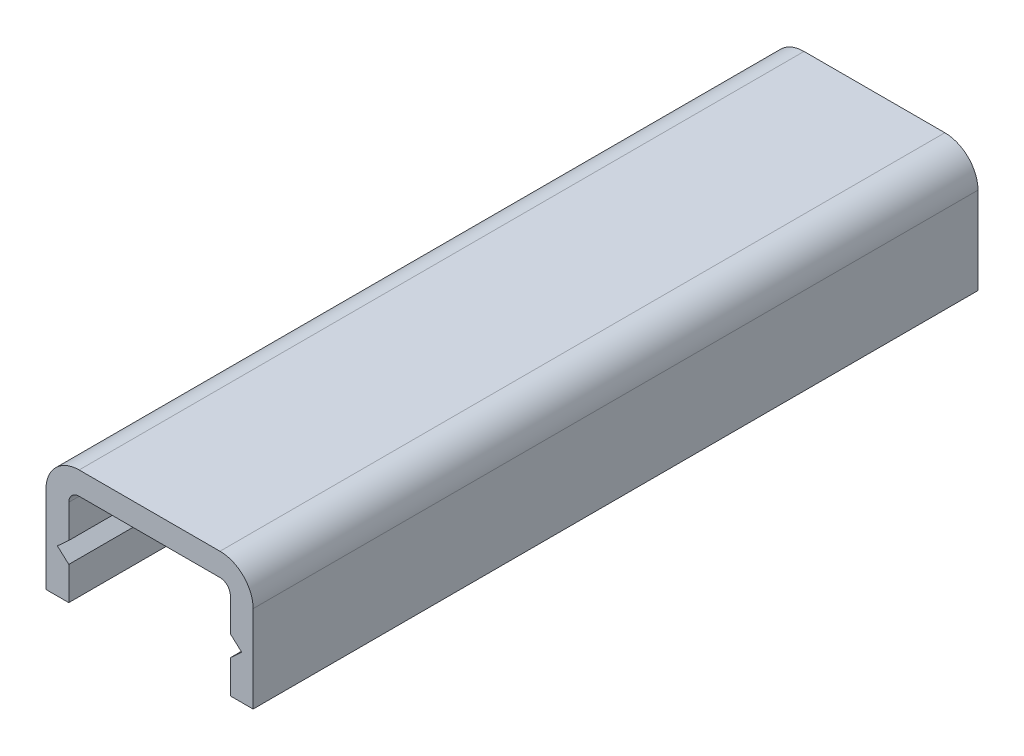
ISO-10303-21;
HEADER;
FILE_DESCRIPTION(('STEP AP214'),'2;1');
FILE_NAME('part.step','',(''),(''),'','','');
FILE_SCHEMA(('AUTOMOTIVE_DESIGN { 1 0 10303 214 1 1 1 1 }'));
ENDSEC;
DATA;
#1=APPLICATION_CONTEXT('core data for automotive mechanical design processes');
#2=APPLICATION_PROTOCOL_DEFINITION('international standard','automotive_design',2000,#1);
#3=PRODUCT_CONTEXT('',#1,'mechanical');
#4=PRODUCT('Part','Part','',(#3));
#5=PRODUCT_RELATED_PRODUCT_CATEGORY('part','',(#4));
#6=PRODUCT_DEFINITION_FORMATION('','',#4);
#7=PRODUCT_DEFINITION_CONTEXT('part definition',#1,'design');
#8=PRODUCT_DEFINITION('design','',#6,#7);
#9=PRODUCT_DEFINITION_SHAPE('','',#8);
#10=(LENGTH_UNIT() NAMED_UNIT(*) SI_UNIT(.MILLI.,.METRE.));
#11=(NAMED_UNIT(*) PLANE_ANGLE_UNIT() SI_UNIT($,.RADIAN.));
#12=(NAMED_UNIT(*) SI_UNIT($,.STERADIAN.) SOLID_ANGLE_UNIT());
#13=UNCERTAINTY_MEASURE_WITH_UNIT(LENGTH_MEASURE(1.E-05),#10,'distance_accuracy_value','');
#14=(GEOMETRIC_REPRESENTATION_CONTEXT(3) GLOBAL_UNCERTAINTY_ASSIGNED_CONTEXT((#13)) GLOBAL_UNIT_ASSIGNED_CONTEXT((#10,
#11,#12)) REPRESENTATION_CONTEXT('',''));
#15=CARTESIAN_POINT('',(0.,0.,0.));
#16=DIRECTION('',(0.,0.,1.));
#17=DIRECTION('',(1.,0.,0.));
#18=AXIS2_PLACEMENT_3D('',#15,#16,#17);
#19=CARTESIAN_POINT('',(0.,-5.8,35.));
#20=DIRECTION('',(0.,1.,0.));
#21=DIRECTION('',(0.,0.,1.));
#22=AXIS2_PLACEMENT_3D('',#19,#20,#21);
#23=PLANE('',#22);
#24=DIRECTION('',(1.,0.,0.));
#25=VECTOR('',#24,1.);
#26=CARTESIAN_POINT('',(0.,-5.8,0.));
#27=LINE('',#26,#25);
#28=CARTESIAN_POINT('',(0.,-5.8,0.));
#29=VERTEX_POINT('',#28);
#30=CARTESIAN_POINT('',(1.1,-5.8,0.));
#31=VERTEX_POINT('',#30);
#32=EDGE_CURVE('E187',#29,#31,#27,.T.);
#33=ORIENTED_EDGE('',*,*,#32,.T.);
#34=DIRECTION('',(0.,0.,-1.));
#35=VECTOR('',#34,1.);
#36=CARTESIAN_POINT('',(1.1,-5.8,35.));
#37=LINE('',#36,#35);
#38=CARTESIAN_POINT('',(1.1,-5.8,35.));
#39=VERTEX_POINT('',#38);
#40=EDGE_CURVE('E11',#39,#31,#37,.T.);
#41=ORIENTED_EDGE('',*,*,#40,.F.);
#42=DIRECTION('',(1.,0.,0.));
#43=VECTOR('',#42,1.);
#44=CARTESIAN_POINT('',(0.,-5.8,35.));
#45=LINE('',#44,#43);
#46=CARTESIAN_POINT('',(0.,-5.8,35.));
#47=VERTEX_POINT('',#46);
#48=EDGE_CURVE('E221',#47,#39,#45,.T.);
#49=ORIENTED_EDGE('',*,*,#48,.F.);
#50=DIRECTION('',(0.,0.,-1.));
#51=VECTOR('',#50,1.);
#52=CARTESIAN_POINT('',(0.,-5.8,35.));
#53=LINE('',#52,#51);
#54=EDGE_CURVE('E183',#47,#29,#53,.T.);
#55=ORIENTED_EDGE('',*,*,#54,.T.);
#56=EDGE_LOOP('',(#33,#41,#49,#55));
#57=FACE_BOUND('',#56,.T.);
#58=ADVANCED_FACE('F31',(#57),#23,.F.);
#59=CARTESIAN_POINT('',(1.1,-4.2,35.));
#60=DIRECTION('',(-1.,0.,0.));
#61=DIRECTION('',(0.,-1.,0.));
#62=AXIS2_PLACEMENT_3D('',#59,#60,#61);
#63=PLANE('',#62);
#64=DIRECTION('',(0.,1.,0.));
#65=VECTOR('',#64,1.);
#66=CARTESIAN_POINT('',(1.1,-4.2,0.));
#67=LINE('',#66,#65);
#68=CARTESIAN_POINT('',(1.1,-4.2,0.));
#69=VERTEX_POINT('',#68);
#70=EDGE_CURVE('E190',#31,#69,#67,.T.);
#71=ORIENTED_EDGE('',*,*,#70,.T.);
#72=DIRECTION('',(0.,0.,-1.));
#73=VECTOR('',#72,1.);
#74=CARTESIAN_POINT('',(1.1,-4.2,35.));
#75=LINE('',#74,#73);
#76=CARTESIAN_POINT('',(1.1,-4.2,35.));
#77=VERTEX_POINT('',#76);
#78=EDGE_CURVE('E39',#77,#69,#75,.T.);
#79=ORIENTED_EDGE('',*,*,#78,.F.);
#80=DIRECTION('',(0.,1.,0.));
#81=VECTOR('',#80,1.);
#82=CARTESIAN_POINT('',(1.1,-4.2,35.));
#83=LINE('',#82,#81);
#84=EDGE_CURVE('E120',#39,#77,#83,.T.);
#85=ORIENTED_EDGE('',*,*,#84,.F.);
#86=ORIENTED_EDGE('',*,*,#40,.T.);
#87=EDGE_LOOP('',(#71,#79,#85,#86));
#88=FACE_BOUND('',#87,.T.);
#89=ADVANCED_FACE('F329',(#88),#63,.F.);
#90=CARTESIAN_POINT('',(1.1,-4.2,35.));
#91=DIRECTION('',(-0.672672793996316,-0.73994007339594,0.));
#92=DIRECTION('',(0.73994007339594,-0.672672793996316,0.));
#93=AXIS2_PLACEMENT_3D('',#90,#91,#92);
#94=PLANE('',#93);
#95=DIRECTION('',(-0.73994007339594,0.672672793996316,0.));
#96=VECTOR('',#95,1.);
#97=CARTESIAN_POINT('',(1.1,-4.2,0.));
#98=LINE('',#97,#96);
#99=CARTESIAN_POINT('',(0.55,-3.7,0.));
#100=VERTEX_POINT('',#99);
#101=EDGE_CURVE('E192',#69,#100,#98,.T.);
#102=ORIENTED_EDGE('',*,*,#101,.T.);
#103=DIRECTION('',(0.,0.,-1.));
#104=VECTOR('',#103,1.);
#105=CARTESIAN_POINT('',(0.55,-3.7,35.));
#106=LINE('',#105,#104);
#107=CARTESIAN_POINT('',(0.55,-3.7,35.));
#108=VERTEX_POINT('',#107);
#109=EDGE_CURVE('E258',#108,#100,#106,.T.);
#110=ORIENTED_EDGE('',*,*,#109,.F.);
#111=DIRECTION('',(-0.73994007339594,0.672672793996316,0.));
#112=VECTOR('',#111,1.);
#113=CARTESIAN_POINT('',(1.1,-4.2,35.));
#114=LINE('',#113,#112);
#115=EDGE_CURVE('E266',#77,#108,#114,.T.);
#116=ORIENTED_EDGE('',*,*,#115,.F.);
#117=ORIENTED_EDGE('',*,*,#78,.T.);
#118=EDGE_LOOP('',(#102,#110,#116,#117));
#119=FACE_BOUND('',#118,.T.);
#120=ADVANCED_FACE('F264',(#119),#94,.F.);
#121=CARTESIAN_POINT('',(1.1,-3.2,35.));
#122=DIRECTION('',(-0.672672793996311,0.739940073395945,0.));
#123=DIRECTION('',(-0.739940073395945,-0.672672793996311,0.));
#124=AXIS2_PLACEMENT_3D('',#121,#122,#123);
#125=PLANE('',#124);
#126=DIRECTION('',(0.739940073395945,0.672672793996311,0.));
#127=VECTOR('',#126,1.);
#128=CARTESIAN_POINT('',(1.1,-3.2,0.));
#129=LINE('',#128,#127);
#130=CARTESIAN_POINT('',(1.1,-3.2,0.));
#131=VERTEX_POINT('',#130);
#132=EDGE_CURVE('E194',#100,#131,#129,.T.);
#133=ORIENTED_EDGE('',*,*,#132,.T.);
#134=DIRECTION('',(0.,0.,-1.));
#135=VECTOR('',#134,1.);
#136=CARTESIAN_POINT('',(1.1,-3.2,35.));
#137=LINE('',#136,#135);
#138=CARTESIAN_POINT('',(1.1,-3.2,35.));
#139=VERTEX_POINT('',#138);
#140=EDGE_CURVE('E255',#139,#131,#137,.T.);
#141=ORIENTED_EDGE('',*,*,#140,.F.);
#142=DIRECTION('',(0.739940073395945,0.672672793996311,0.));
#143=VECTOR('',#142,1.);
#144=CARTESIAN_POINT('',(1.1,-3.2,35.));
#145=LINE('',#144,#143);
#146=EDGE_CURVE('E284',#108,#139,#145,.T.);
#147=ORIENTED_EDGE('',*,*,#146,.F.);
#148=ORIENTED_EDGE('',*,*,#109,.T.);
#149=EDGE_LOOP('',(#133,#141,#147,#148));
#150=FACE_BOUND('',#149,.T.);
#151=ADVANCED_FACE('F275',(#150),#125,.F.);
#152=CARTESIAN_POINT('',(1.1,-1.6,35.));
#153=DIRECTION('',(-1.,0.,0.));
#154=DIRECTION('',(0.,0.,1.));
#155=AXIS2_PLACEMENT_3D('',#152,#153,#154);
#156=PLANE('',#155);
#157=DIRECTION('',(0.,1.,0.));
#158=VECTOR('',#157,1.);
#159=CARTESIAN_POINT('',(1.1,-1.6,0.));
#160=LINE('',#159,#158);
#161=CARTESIAN_POINT('',(1.1,-1.6,0.));
#162=VERTEX_POINT('',#161);
#163=EDGE_CURVE('E196',#131,#162,#160,.T.);
#164=ORIENTED_EDGE('',*,*,#163,.T.);
#165=DIRECTION('',(0.,0.,-1.));
#166=VECTOR('',#165,1.);
#167=CARTESIAN_POINT('',(1.1,-1.6,35.));
#168=LINE('',#167,#166);
#169=CARTESIAN_POINT('',(1.1,-1.6,35.));
#170=VERTEX_POINT('',#169);
#171=EDGE_CURVE('E252',#170,#162,#168,.T.);
#172=ORIENTED_EDGE('',*,*,#171,.F.);
#173=DIRECTION('',(0.,1.,0.));
#174=VECTOR('',#173,1.);
#175=CARTESIAN_POINT('',(1.1,-1.6,35.));
#176=LINE('',#175,#174);
#177=EDGE_CURVE('E281',#139,#170,#176,.T.);
#178=ORIENTED_EDGE('',*,*,#177,.F.);
#179=ORIENTED_EDGE('',*,*,#140,.T.);
#180=EDGE_LOOP('',(#164,#172,#178,#179));
#181=FACE_BOUND('',#180,.T.);
#182=ADVANCED_FACE('F279',(#181),#156,.F.);
#183=CARTESIAN_POINT('',(1.6,-1.6,35.));
#184=DIRECTION('',(0.,0.,-1.));
#185=DIRECTION('',(-1.,0.,0.));
#186=AXIS2_PLACEMENT_3D('',#183,#184,#185);
#187=CYLINDRICAL_SURFACE('',#186,0.5);
#188=CARTESIAN_POINT('',(1.6,-1.6,0.));
#189=DIRECTION('',(0.,0.,-1.));
#190=DIRECTION('',(1.,0.,0.));
#191=AXIS2_PLACEMENT_3D('',#188,#189,#190);
#192=CIRCLE('',#191,0.5);
#193=CARTESIAN_POINT('',(1.6,-1.1,0.));
#194=VERTEX_POINT('',#193);
#195=EDGE_CURVE('E198',#162,#194,#192,.T.);
#196=ORIENTED_EDGE('',*,*,#195,.T.);
#197=DIRECTION('',(0.,0.,-1.));
#198=VECTOR('',#197,1.);
#199=CARTESIAN_POINT('',(1.6,-1.1,35.));
#200=LINE('',#199,#198);
#201=CARTESIAN_POINT('',(1.6,-1.1,35.));
#202=VERTEX_POINT('',#201);
#203=EDGE_CURVE('E249',#202,#194,#200,.T.);
#204=ORIENTED_EDGE('',*,*,#203,.F.);
#205=CARTESIAN_POINT('',(1.6,-1.6,35.));
#206=DIRECTION('',(0.,0.,-1.));
#207=DIRECTION('',(1.,0.,0.));
#208=AXIS2_PLACEMENT_3D('',#205,#206,#207);
#209=CIRCLE('',#208,0.5);
#210=EDGE_CURVE('E283',#170,#202,#209,.T.);
#211=ORIENTED_EDGE('',*,*,#210,.F.);
#212=ORIENTED_EDGE('',*,*,#171,.T.);
#213=EDGE_LOOP('',(#196,#204,#211,#212));
#214=FACE_BOUND('',#213,.T.);
#215=ADVANCED_FACE('F342',(#214),#187,.F.);
#216=CARTESIAN_POINT('',(1.6,-1.1,35.));
#217=DIRECTION('',(0.,1.,0.));
#218=DIRECTION('',(0.,0.,1.));
#219=AXIS2_PLACEMENT_3D('',#216,#217,#218);
#220=PLANE('',#219);
#221=DIRECTION('',(1.,0.,0.));
#222=VECTOR('',#221,1.);
#223=CARTESIAN_POINT('',(1.6,-1.1,0.));
#224=LINE('',#223,#222);
#225=CARTESIAN_POINT('',(8.4,-1.1,0.));
#226=VERTEX_POINT('',#225);
#227=EDGE_CURVE('E200',#194,#226,#224,.T.);
#228=ORIENTED_EDGE('',*,*,#227,.T.);
#229=DIRECTION('',(0.,0.,-1.));
#230=VECTOR('',#229,1.);
#231=CARTESIAN_POINT('',(8.4,-1.1,35.));
#232=LINE('',#231,#230);
#233=CARTESIAN_POINT('',(8.4,-1.1,35.));
#234=VERTEX_POINT('',#233);
#235=EDGE_CURVE('E246',#234,#226,#232,.T.);
#236=ORIENTED_EDGE('',*,*,#235,.F.);
#237=DIRECTION('',(1.,0.,0.));
#238=VECTOR('',#237,1.);
#239=CARTESIAN_POINT('',(1.6,-1.1,35.));
#240=LINE('',#239,#238);
#241=EDGE_CURVE('E286',#202,#234,#240,.T.);
#242=ORIENTED_EDGE('',*,*,#241,.F.);
#243=ORIENTED_EDGE('',*,*,#203,.T.);
#244=EDGE_LOOP('',(#228,#236,#242,#243));
#245=FACE_BOUND('',#244,.T.);
#246=ADVANCED_FACE('F345',(#245),#220,.F.);
#247=CARTESIAN_POINT('',(8.4,-1.6,35.));
#248=DIRECTION('',(0.,0.,-1.));
#249=DIRECTION('',(-1.,0.,0.));
#250=AXIS2_PLACEMENT_3D('',#247,#248,#249);
#251=CYLINDRICAL_SURFACE('',#250,0.5);
#252=CARTESIAN_POINT('',(8.4,-1.6,0.));
#253=DIRECTION('',(0.,0.,-1.));
#254=DIRECTION('',(1.,0.,0.));
#255=AXIS2_PLACEMENT_3D('',#252,#253,#254);
#256=CIRCLE('',#255,0.5);
#257=CARTESIAN_POINT('',(8.9,-1.6,0.));
#258=VERTEX_POINT('',#257);
#259=EDGE_CURVE('E202',#226,#258,#256,.T.);
#260=ORIENTED_EDGE('',*,*,#259,.T.);
#261=DIRECTION('',(0.,0.,-1.));
#262=VECTOR('',#261,1.);
#263=CARTESIAN_POINT('',(8.9,-1.6,35.));
#264=LINE('',#263,#262);
#265=CARTESIAN_POINT('',(8.9,-1.6,35.));
#266=VERTEX_POINT('',#265);
#267=EDGE_CURVE('E243',#266,#258,#264,.T.);
#268=ORIENTED_EDGE('',*,*,#267,.F.);
#269=CARTESIAN_POINT('',(8.4,-1.6,35.));
#270=DIRECTION('',(0.,0.,-1.));
#271=DIRECTION('',(1.,0.,0.));
#272=AXIS2_PLACEMENT_3D('',#269,#270,#271);
#273=CIRCLE('',#272,0.5);
#274=EDGE_CURVE('E292',#234,#266,#273,.T.);
#275=ORIENTED_EDGE('',*,*,#274,.F.);
#276=ORIENTED_EDGE('',*,*,#235,.T.);
#277=EDGE_LOOP('',(#260,#268,#275,#276));
#278=FACE_BOUND('',#277,.T.);
#279=ADVANCED_FACE('F349',(#278),#251,.F.);
#280=CARTESIAN_POINT('',(8.9,-1.6,35.));
#281=DIRECTION('',(1.,0.,0.));
#282=DIRECTION('',(0.,1.,0.));
#283=AXIS2_PLACEMENT_3D('',#280,#281,#282);
#284=PLANE('',#283);
#285=DIRECTION('',(0.,-1.,0.));
#286=VECTOR('',#285,1.);
#287=CARTESIAN_POINT('',(8.9,-1.6,0.));
#288=LINE('',#287,#286);
#289=CARTESIAN_POINT('',(8.9,-3.2,0.));
#290=VERTEX_POINT('',#289);
#291=EDGE_CURVE('E204',#258,#290,#288,.T.);
#292=ORIENTED_EDGE('',*,*,#291,.T.);
#293=DIRECTION('',(0.,0.,-1.));
#294=VECTOR('',#293,1.);
#295=CARTESIAN_POINT('',(8.9,-3.2,35.));
#296=LINE('',#295,#294);
#297=CARTESIAN_POINT('',(8.9,-3.2,35.));
#298=VERTEX_POINT('',#297);
#299=EDGE_CURVE('E240',#298,#290,#296,.T.);
#300=ORIENTED_EDGE('',*,*,#299,.F.);
#301=DIRECTION('',(0.,-1.,0.));
#302=VECTOR('',#301,1.);
#303=CARTESIAN_POINT('',(8.9,-1.6,35.));
#304=LINE('',#303,#302);
#305=EDGE_CURVE('E294',#266,#298,#304,.T.);
#306=ORIENTED_EDGE('',*,*,#305,.F.);
#307=ORIENTED_EDGE('',*,*,#267,.T.);
#308=EDGE_LOOP('',(#292,#300,#306,#307));
#309=FACE_BOUND('',#308,.T.);
#310=ADVANCED_FACE('F353',(#309),#284,.F.);
#311=CARTESIAN_POINT('',(8.9,-3.2,35.));
#312=DIRECTION('',(0.672672793996311,0.739940073395945,0.));
#313=DIRECTION('',(-0.739940073395945,0.672672793996311,0.));
#314=AXIS2_PLACEMENT_3D('',#311,#312,#313);
#315=PLANE('',#314);
#316=DIRECTION('',(0.739940073395945,-0.672672793996311,0.));
#317=VECTOR('',#316,1.);
#318=CARTESIAN_POINT('',(8.9,-3.2,0.));
#319=LINE('',#318,#317);
#320=CARTESIAN_POINT('',(9.45,-3.7,0.));
#321=VERTEX_POINT('',#320);
#322=EDGE_CURVE('E206',#290,#321,#319,.T.);
#323=ORIENTED_EDGE('',*,*,#322,.T.);
#324=DIRECTION('',(0.,0.,-1.));
#325=VECTOR('',#324,1.);
#326=CARTESIAN_POINT('',(9.45,-3.7,35.));
#327=LINE('',#326,#325);
#328=CARTESIAN_POINT('',(9.45,-3.7,35.));
#329=VERTEX_POINT('',#328);
#330=EDGE_CURVE('E237',#329,#321,#327,.T.);
#331=ORIENTED_EDGE('',*,*,#330,.F.);
#332=DIRECTION('',(0.739940073395945,-0.672672793996311,0.));
#333=VECTOR('',#332,1.);
#334=CARTESIAN_POINT('',(8.9,-3.2,35.));
#335=LINE('',#334,#333);
#336=EDGE_CURVE('E296',#298,#329,#335,.T.);
#337=ORIENTED_EDGE('',*,*,#336,.F.);
#338=ORIENTED_EDGE('',*,*,#299,.T.);
#339=EDGE_LOOP('',(#323,#331,#337,#338));
#340=FACE_BOUND('',#339,.T.);
#341=ADVANCED_FACE('F357',(#340),#315,.F.);
#342=CARTESIAN_POINT('',(8.9,-4.2,35.));
#343=DIRECTION('',(0.672672793996316,-0.73994007339594,0.));
#344=DIRECTION('',(0.739940073395941,0.672672793996316,0.));
#345=AXIS2_PLACEMENT_3D('',#342,#343,#344);
#346=PLANE('',#345);
#347=DIRECTION('',(-0.73994007339594,-0.672672793996316,0.));
#348=VECTOR('',#347,1.);
#349=CARTESIAN_POINT('',(8.9,-4.2,0.));
#350=LINE('',#349,#348);
#351=CARTESIAN_POINT('',(8.9,-4.2,0.));
#352=VERTEX_POINT('',#351);
#353=EDGE_CURVE('E208',#321,#352,#350,.T.);
#354=ORIENTED_EDGE('',*,*,#353,.T.);
#355=DIRECTION('',(0.,0.,-1.));
#356=VECTOR('',#355,1.);
#357=CARTESIAN_POINT('',(8.9,-4.2,35.));
#358=LINE('',#357,#356);
#359=CARTESIAN_POINT('',(8.9,-4.2,35.));
#360=VERTEX_POINT('',#359);
#361=EDGE_CURVE('E234',#360,#352,#358,.T.);
#362=ORIENTED_EDGE('',*,*,#361,.F.);
#363=DIRECTION('',(-0.73994007339594,-0.672672793996316,0.));
#364=VECTOR('',#363,1.);
#365=CARTESIAN_POINT('',(8.9,-4.2,35.));
#366=LINE('',#365,#364);
#367=EDGE_CURVE('E298',#329,#360,#366,.T.);
#368=ORIENTED_EDGE('',*,*,#367,.F.);
#369=ORIENTED_EDGE('',*,*,#330,.T.);
#370=EDGE_LOOP('',(#354,#362,#368,#369));
#371=FACE_BOUND('',#370,.T.);
#372=ADVANCED_FACE('F361',(#371),#346,.F.);
#373=CARTESIAN_POINT('',(8.9,-4.2,35.));
#374=DIRECTION('',(1.,0.,0.));
#375=DIRECTION('',(0.,1.,0.));
#376=AXIS2_PLACEMENT_3D('',#373,#374,#375);
#377=PLANE('',#376);
#378=DIRECTION('',(0.,-1.,0.));
#379=VECTOR('',#378,1.);
#380=CARTESIAN_POINT('',(8.9,-4.2,0.));
#381=LINE('',#380,#379);
#382=CARTESIAN_POINT('',(8.9,-5.8,0.));
#383=VERTEX_POINT('',#382);
#384=EDGE_CURVE('E210',#352,#383,#381,.T.);
#385=ORIENTED_EDGE('',*,*,#384,.T.);
#386=DIRECTION('',(0.,0.,-1.));
#387=VECTOR('',#386,1.);
#388=CARTESIAN_POINT('',(8.9,-5.8,35.));
#389=LINE('',#388,#387);
#390=CARTESIAN_POINT('',(8.9,-5.8,35.));
#391=VERTEX_POINT('',#390);
#392=EDGE_CURVE('E231',#391,#383,#389,.T.);
#393=ORIENTED_EDGE('',*,*,#392,.F.);
#394=DIRECTION('',(0.,-1.,0.));
#395=VECTOR('',#394,1.);
#396=CARTESIAN_POINT('',(8.9,-4.2,35.));
#397=LINE('',#396,#395);
#398=EDGE_CURVE('E300',#360,#391,#397,.T.);
#399=ORIENTED_EDGE('',*,*,#398,.F.);
#400=ORIENTED_EDGE('',*,*,#361,.T.);
#401=EDGE_LOOP('',(#385,#393,#399,#400));
#402=FACE_BOUND('',#401,.T.);
#403=ADVANCED_FACE('F365',(#402),#377,.F.);
#404=CARTESIAN_POINT('',(10.,-5.8,35.));
#405=DIRECTION('',(0.,1.,0.));
#406=DIRECTION('',(0.,0.,1.));
#407=AXIS2_PLACEMENT_3D('',#404,#405,#406);
#408=PLANE('',#407);
#409=DIRECTION('',(1.,0.,0.));
#410=VECTOR('',#409,1.);
#411=CARTESIAN_POINT('',(10.,-5.8,0.));
#412=LINE('',#411,#410);
#413=CARTESIAN_POINT('',(10.,-5.8,0.));
#414=VERTEX_POINT('',#413);
#415=EDGE_CURVE('E212',#383,#414,#412,.T.);
#416=ORIENTED_EDGE('',*,*,#415,.T.);
#417=DIRECTION('',(0.,0.,-1.));
#418=VECTOR('',#417,1.);
#419=CARTESIAN_POINT('',(10.,-5.8,35.));
#420=LINE('',#419,#418);
#421=CARTESIAN_POINT('',(10.,-5.8,35.));
#422=VERTEX_POINT('',#421);
#423=EDGE_CURVE('E228',#422,#414,#420,.T.);
#424=ORIENTED_EDGE('',*,*,#423,.F.);
#425=DIRECTION('',(1.,0.,0.));
#426=VECTOR('',#425,1.);
#427=CARTESIAN_POINT('',(10.,-5.8,35.));
#428=LINE('',#427,#426);
#429=EDGE_CURVE('E302',#391,#422,#428,.T.);
#430=ORIENTED_EDGE('',*,*,#429,.F.);
#431=ORIENTED_EDGE('',*,*,#392,.T.);
#432=EDGE_LOOP('',(#416,#424,#430,#431));
#433=FACE_BOUND('',#432,.T.);
#434=ADVANCED_FACE('F369',(#433),#408,.F.);
#435=CARTESIAN_POINT('',(10.,-1.60000000000001,35.));
#436=DIRECTION('',(-1.,0.,0.));
#437=DIRECTION('',(0.,0.,1.));
#438=AXIS2_PLACEMENT_3D('',#435,#436,#437);
#439=PLANE('',#438);
#440=DIRECTION('',(0.,1.,0.));
#441=VECTOR('',#440,1.);
#442=CARTESIAN_POINT('',(10.,-1.60000000000001,0.));
#443=LINE('',#442,#441);
#444=CARTESIAN_POINT('',(10.,-1.60000000000001,0.));
#445=VERTEX_POINT('',#444);
#446=EDGE_CURVE('E214',#414,#445,#443,.T.);
#447=ORIENTED_EDGE('',*,*,#446,.T.);
#448=DIRECTION('',(0.,0.,-1.));
#449=VECTOR('',#448,1.);
#450=CARTESIAN_POINT('',(10.,-1.60000000000001,35.));
#451=LINE('',#450,#449);
#452=CARTESIAN_POINT('',(10.,-1.60000000000001,35.));
#453=VERTEX_POINT('',#452);
#454=EDGE_CURVE('E225',#453,#445,#451,.T.);
#455=ORIENTED_EDGE('',*,*,#454,.F.);
#456=DIRECTION('',(0.,1.,0.));
#457=VECTOR('',#456,1.);
#458=CARTESIAN_POINT('',(10.,-1.60000000000001,35.));
#459=LINE('',#458,#457);
#460=EDGE_CURVE('E304',#422,#453,#459,.T.);
#461=ORIENTED_EDGE('',*,*,#460,.F.);
#462=ORIENTED_EDGE('',*,*,#423,.T.);
#463=EDGE_LOOP('',(#447,#455,#461,#462));
#464=FACE_BOUND('',#463,.T.);
#465=ADVANCED_FACE('F310',(#464),#439,.F.);
#466=CARTESIAN_POINT('',(8.4,-1.6,35.));
#467=DIRECTION('',(0.,0.,-1.));
#468=DIRECTION('',(-1.,0.,0.));
#469=AXIS2_PLACEMENT_3D('',#466,#467,#468);
#470=CYLINDRICAL_SURFACE('',#469,1.6);
#471=CARTESIAN_POINT('',(8.4,-1.6,0.));
#472=DIRECTION('',(0.,0.,1.));
#473=DIRECTION('',(-1.,0.,0.));
#474=AXIS2_PLACEMENT_3D('',#471,#472,#473);
#475=CIRCLE('',#474,1.6);
#476=CARTESIAN_POINT('',(8.39999999999999,0.,0.));
#477=VERTEX_POINT('',#476);
#478=EDGE_CURVE('E216',#445,#477,#475,.T.);
#479=ORIENTED_EDGE('',*,*,#478,.T.);
#480=DIRECTION('',(0.,0.,-1.));
#481=VECTOR('',#480,1.);
#482=CARTESIAN_POINT('',(8.39999999999999,0.,35.));
#483=LINE('',#482,#481);
#484=CARTESIAN_POINT('',(8.39999999999999,0.,35.));
#485=VERTEX_POINT('',#484);
#486=EDGE_CURVE('E178',#485,#477,#483,.T.);
#487=ORIENTED_EDGE('',*,*,#486,.F.);
#488=CARTESIAN_POINT('',(8.4,-1.6,35.));
#489=DIRECTION('',(0.,0.,1.));
#490=DIRECTION('',(-1.,0.,0.));
#491=AXIS2_PLACEMENT_3D('',#488,#489,#490);
#492=CIRCLE('',#491,1.6);
#493=EDGE_CURVE('E169',#453,#485,#492,.T.);
#494=ORIENTED_EDGE('',*,*,#493,.F.);
#495=ORIENTED_EDGE('',*,*,#454,.T.);
#496=EDGE_LOOP('',(#479,#487,#494,#495));
#497=FACE_BOUND('',#496,.T.);
#498=ADVANCED_FACE('F314',(#497),#470,.T.);
#499=CARTESIAN_POINT('',(1.60000000000001,0.,35.));
#500=DIRECTION('',(0.,-1.,0.));
#501=DIRECTION('',(0.,0.,-1.));
#502=AXIS2_PLACEMENT_3D('',#499,#500,#501);
#503=PLANE('',#502);
#504=DIRECTION('',(-1.,0.,0.));
#505=VECTOR('',#504,1.);
#506=CARTESIAN_POINT('',(1.60000000000001,0.,0.));
#507=LINE('',#506,#505);
#508=CARTESIAN_POINT('',(1.60000000000001,0.,0.));
#509=VERTEX_POINT('',#508);
#510=EDGE_CURVE('E177',#477,#509,#507,.T.);
#511=ORIENTED_EDGE('',*,*,#510,.T.);
#512=DIRECTION('',(0.,0.,-1.));
#513=VECTOR('',#512,1.);
#514=CARTESIAN_POINT('',(1.60000000000001,0.,35.));
#515=LINE('',#514,#513);
#516=CARTESIAN_POINT('',(1.60000000000001,0.,35.));
#517=VERTEX_POINT('',#516);
#518=EDGE_CURVE('E174',#517,#509,#515,.T.);
#519=ORIENTED_EDGE('',*,*,#518,.F.);
#520=DIRECTION('',(-1.,0.,0.));
#521=VECTOR('',#520,1.);
#522=CARTESIAN_POINT('',(1.60000000000001,0.,35.));
#523=LINE('',#522,#521);
#524=EDGE_CURVE('E163',#485,#517,#523,.T.);
#525=ORIENTED_EDGE('',*,*,#524,.F.);
#526=ORIENTED_EDGE('',*,*,#486,.T.);
#527=EDGE_LOOP('',(#511,#519,#525,#526));
#528=FACE_BOUND('',#527,.T.);
#529=ADVANCED_FACE('F175',(#528),#503,.F.);
#530=CARTESIAN_POINT('',(1.6,-1.6,35.));
#531=DIRECTION('',(0.,0.,-1.));
#532=DIRECTION('',(-1.,0.,0.));
#533=AXIS2_PLACEMENT_3D('',#530,#531,#532);
#534=CYLINDRICAL_SURFACE('',#533,1.6);
#535=CARTESIAN_POINT('',(1.6,-1.6,0.));
#536=DIRECTION('',(0.,0.,1.));
#537=DIRECTION('',(-1.,0.,0.));
#538=AXIS2_PLACEMENT_3D('',#535,#536,#537);
#539=CIRCLE('',#538,1.6);
#540=CARTESIAN_POINT('',(0.,-1.60000000000001,0.));
#541=VERTEX_POINT('',#540);
#542=EDGE_CURVE('E106',#509,#541,#539,.T.);
#543=ORIENTED_EDGE('',*,*,#542,.T.);
#544=DIRECTION('',(0.,0.,-1.));
#545=VECTOR('',#544,1.);
#546=CARTESIAN_POINT('',(0.,-1.60000000000001,35.));
#547=LINE('',#546,#545);
#548=CARTESIAN_POINT('',(0.,-1.60000000000001,35.));
#549=VERTEX_POINT('',#548);
#550=EDGE_CURVE('E179',#549,#541,#547,.T.);
#551=ORIENTED_EDGE('',*,*,#550,.F.);
#552=CARTESIAN_POINT('',(1.6,-1.6,35.));
#553=DIRECTION('',(0.,0.,1.));
#554=DIRECTION('',(-1.,0.,0.));
#555=AXIS2_PLACEMENT_3D('',#552,#553,#554);
#556=CIRCLE('',#555,1.6);
#557=EDGE_CURVE('E167',#517,#549,#556,.T.);
#558=ORIENTED_EDGE('',*,*,#557,.F.);
#559=ORIENTED_EDGE('',*,*,#518,.T.);
#560=EDGE_LOOP('',(#543,#551,#558,#559));
#561=FACE_BOUND('',#560,.T.);
#562=ADVANCED_FACE('F181',(#561),#534,.T.);
#563=CARTESIAN_POINT('',(0.,-1.60000000000001,35.));
#564=DIRECTION('',(1.,0.,0.));
#565=DIRECTION('',(0.,0.,-1.));
#566=AXIS2_PLACEMENT_3D('',#563,#564,#565);
#567=PLANE('',#566);
#568=DIRECTION('',(0.,-1.,0.));
#569=VECTOR('',#568,1.);
#570=CARTESIAN_POINT('',(0.,-1.60000000000001,0.));
#571=LINE('',#570,#569);
#572=EDGE_CURVE('E112',#541,#29,#571,.T.);
#573=ORIENTED_EDGE('',*,*,#572,.T.);
#574=ORIENTED_EDGE('',*,*,#54,.F.);
#575=DIRECTION('',(0.,-1.,0.));
#576=VECTOR('',#575,1.);
#577=CARTESIAN_POINT('',(0.,-1.60000000000001,35.));
#578=LINE('',#577,#576);
#579=EDGE_CURVE('E47',#549,#47,#578,.T.);
#580=ORIENTED_EDGE('',*,*,#579,.F.);
#581=ORIENTED_EDGE('',*,*,#550,.T.);
#582=EDGE_LOOP('',(#573,#574,#580,#581));
#583=FACE_BOUND('',#582,.T.);
#584=ADVANCED_FACE('F318',(#583),#567,.F.);
#585=CARTESIAN_POINT('',(1.6,-1.6,35.));
#586=DIRECTION('',(0.,0.,1.));
#587=DIRECTION('',(1.,0.,0.));
#588=AXIS2_PLACEMENT_3D('',#585,#586,#587);
#589=PLANE('',#588);
#590=ORIENTED_EDGE('',*,*,#48,.T.);
#591=ORIENTED_EDGE('',*,*,#84,.T.);
#592=ORIENTED_EDGE('',*,*,#115,.T.);
#593=ORIENTED_EDGE('',*,*,#146,.T.);
#594=ORIENTED_EDGE('',*,*,#177,.T.);
#595=ORIENTED_EDGE('',*,*,#210,.T.);
#596=ORIENTED_EDGE('',*,*,#241,.T.);
#597=ORIENTED_EDGE('',*,*,#274,.T.);
#598=ORIENTED_EDGE('',*,*,#305,.T.);
#599=ORIENTED_EDGE('',*,*,#336,.T.);
#600=ORIENTED_EDGE('',*,*,#367,.T.);
#601=ORIENTED_EDGE('',*,*,#398,.T.);
#602=ORIENTED_EDGE('',*,*,#429,.T.);
#603=ORIENTED_EDGE('',*,*,#460,.T.);
#604=ORIENTED_EDGE('',*,*,#493,.T.);
#605=ORIENTED_EDGE('',*,*,#524,.T.);
#606=ORIENTED_EDGE('',*,*,#557,.T.);
#607=ORIENTED_EDGE('',*,*,#579,.T.);
#608=EDGE_LOOP('',(#590,#591,#592,#593,#594,#595,#596,#597,#598,#599,#600,#601,#602,#603,#604,
#605,#606,#607));
#609=FACE_BOUND('',#608,.T.);
#610=ADVANCED_FACE('F165',(#609),#589,.T.);
#611=CARTESIAN_POINT('',(1.6,-1.6,0.));
#612=DIRECTION('',(0.,0.,1.));
#613=DIRECTION('',(1.,0.,0.));
#614=AXIS2_PLACEMENT_3D('',#611,#612,#613);
#615=PLANE('',#614);
#616=ORIENTED_EDGE('',*,*,#32,.F.);
#617=ORIENTED_EDGE('',*,*,#572,.F.);
#618=ORIENTED_EDGE('',*,*,#542,.F.);
#619=ORIENTED_EDGE('',*,*,#510,.F.);
#620=ORIENTED_EDGE('',*,*,#478,.F.);
#621=ORIENTED_EDGE('',*,*,#446,.F.);
#622=ORIENTED_EDGE('',*,*,#415,.F.);
#623=ORIENTED_EDGE('',*,*,#384,.F.);
#624=ORIENTED_EDGE('',*,*,#353,.F.);
#625=ORIENTED_EDGE('',*,*,#322,.F.);
#626=ORIENTED_EDGE('',*,*,#291,.F.);
#627=ORIENTED_EDGE('',*,*,#259,.F.);
#628=ORIENTED_EDGE('',*,*,#227,.F.);
#629=ORIENTED_EDGE('',*,*,#195,.F.);
#630=ORIENTED_EDGE('',*,*,#163,.F.);
#631=ORIENTED_EDGE('',*,*,#132,.F.);
#632=ORIENTED_EDGE('',*,*,#101,.F.);
#633=ORIENTED_EDGE('',*,*,#70,.F.);
#634=EDGE_LOOP('',(#616,#617,#618,#619,#620,#621,#622,#623,#624,#625,#626,#627,#628,#629,#630,
#631,#632,#633));
#635=FACE_BOUND('',#634,.T.);
#636=ADVANCED_FACE('F270',(#635),#615,.F.);
#637=CLOSED_SHELL('',(#58,#89,#120,#151,#182,#215,#246,#279,#310,#341,#372,#403,#434,#465,#498,
#529,#562,#584,#610,#636));
#638=MANIFOLD_SOLID_BREP('B2',#637);
#639=ADVANCED_BREP_SHAPE_REPRESENTATION('',(#18,#638),#14);
#640=SHAPE_DEFINITION_REPRESENTATION(#9,#639);
ENDSEC;
END-ISO-10303-21;
